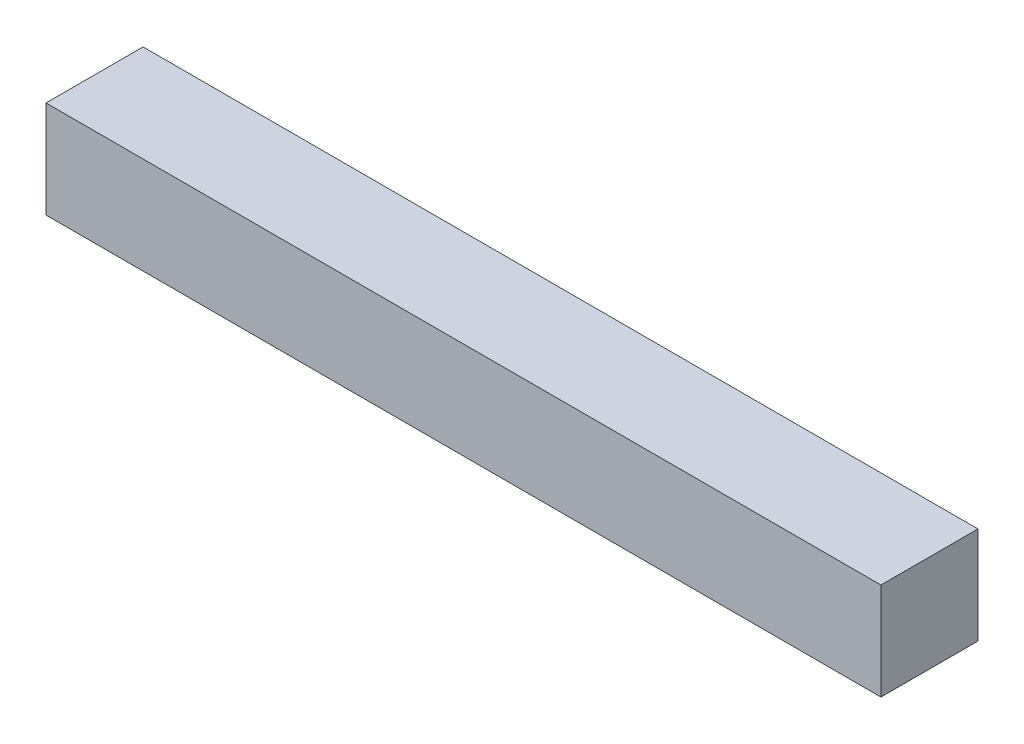
ISO-10303-21;
HEADER;
FILE_DESCRIPTION(('STEP AP214'),'2;1');
FILE_NAME('part.step','',(''),(''),'','','');
FILE_SCHEMA(('AUTOMOTIVE_DESIGN { 1 0 10303 214 1 1 1 1 }'));
ENDSEC;
DATA;
#1=APPLICATION_CONTEXT('core data for automotive mechanical design processes');
#2=APPLICATION_PROTOCOL_DEFINITION('international standard','automotive_design',2000,#1);
#3=PRODUCT_CONTEXT('',#1,'mechanical');
#4=PRODUCT('Part','Part','',(#3));
#5=PRODUCT_RELATED_PRODUCT_CATEGORY('part','',(#4));
#6=PRODUCT_DEFINITION_FORMATION('','',#4);
#7=PRODUCT_DEFINITION_CONTEXT('part definition',#1,'design');
#8=PRODUCT_DEFINITION('design','',#6,#7);
#9=PRODUCT_DEFINITION_SHAPE('','',#8);
#10=(LENGTH_UNIT() NAMED_UNIT(*) SI_UNIT(.MILLI.,.METRE.));
#11=(NAMED_UNIT(*) PLANE_ANGLE_UNIT() SI_UNIT($,.RADIAN.));
#12=(NAMED_UNIT(*) SI_UNIT($,.STERADIAN.) SOLID_ANGLE_UNIT());
#13=UNCERTAINTY_MEASURE_WITH_UNIT(LENGTH_MEASURE(1.E-05),#10,'distance_accuracy_value','');
#14=(GEOMETRIC_REPRESENTATION_CONTEXT(3) GLOBAL_UNCERTAINTY_ASSIGNED_CONTEXT((#13)) GLOBAL_UNIT_ASSIGNED_CONTEXT((#10,
#11,#12)) REPRESENTATION_CONTEXT('',''));
#15=CARTESIAN_POINT('',(0.,0.,0.));
#16=DIRECTION('',(0.,0.,1.));
#17=DIRECTION('',(1.,0.,0.));
#18=AXIS2_PLACEMENT_3D('',#15,#16,#17);
#19=CARTESIAN_POINT('',(86.,-5.,-5.));
#20=DIRECTION('',(0.,0.,1.));
#21=DIRECTION('',(1.,0.,0.));
#22=AXIS2_PLACEMENT_3D('',#19,#20,#21);
#23=PLANE('',#22);
#24=DIRECTION('',(0.,1.,0.));
#25=VECTOR('',#24,1.);
#26=CARTESIAN_POINT('',(0.,-5.,-5.));
#27=LINE('',#26,#25);
#28=CARTESIAN_POINT('',(0.,-5.,-5.));
#29=VERTEX_POINT('',#28);
#30=CARTESIAN_POINT('',(0.,5.,-5.));
#31=VERTEX_POINT('',#30);
#32=EDGE_CURVE('E101',#29,#31,#27,.T.);
#33=ORIENTED_EDGE('',*,*,#32,.T.);
#34=DIRECTION('',(-1.,0.,0.));
#35=VECTOR('',#34,1.);
#36=CARTESIAN_POINT('',(86.,5.,-5.));
#37=LINE('',#36,#35);
#38=CARTESIAN_POINT('',(86.,5.,-5.));
#39=VERTEX_POINT('',#38);
#40=EDGE_CURVE('E11',#39,#31,#37,.T.);
#41=ORIENTED_EDGE('',*,*,#40,.F.);
#42=DIRECTION('',(0.,1.,0.));
#43=VECTOR('',#42,1.);
#44=CARTESIAN_POINT('',(86.,-5.,-5.));
#45=LINE('',#44,#43);
#46=CARTESIAN_POINT('',(86.,-5.,-5.));
#47=VERTEX_POINT('',#46);
#48=EDGE_CURVE('E89',#47,#39,#45,.T.);
#49=ORIENTED_EDGE('',*,*,#48,.F.);
#50=DIRECTION('',(-1.,0.,0.));
#51=VECTOR('',#50,1.);
#52=CARTESIAN_POINT('',(86.,-5.,-5.));
#53=LINE('',#52,#51);
#54=EDGE_CURVE('E97',#47,#29,#53,.T.);
#55=ORIENTED_EDGE('',*,*,#54,.T.);
#56=EDGE_LOOP('',(#33,#41,#49,#55));
#57=FACE_BOUND('',#56,.T.);
#58=ADVANCED_FACE('F38',(#57),#23,.F.);
#59=CARTESIAN_POINT('',(86.,5.,5.));
#60=DIRECTION('',(0.,-1.,0.));
#61=DIRECTION('',(0.,0.,-1.));
#62=AXIS2_PLACEMENT_3D('',#59,#60,#61);
#63=PLANE('',#62);
#64=DIRECTION('',(0.,0.,1.));
#65=VECTOR('',#64,1.);
#66=CARTESIAN_POINT('',(0.,5.,5.));
#67=LINE('',#66,#65);
#68=CARTESIAN_POINT('',(0.,5.,5.));
#69=VERTEX_POINT('',#68);
#70=EDGE_CURVE('E93',#31,#69,#67,.T.);
#71=ORIENTED_EDGE('',*,*,#70,.T.);
#72=DIRECTION('',(-1.,0.,0.));
#73=VECTOR('',#72,1.);
#74=CARTESIAN_POINT('',(86.,5.,5.));
#75=LINE('',#74,#73);
#76=CARTESIAN_POINT('',(86.,5.,5.));
#77=VERTEX_POINT('',#76);
#78=EDGE_CURVE('E46',#77,#69,#75,.T.);
#79=ORIENTED_EDGE('',*,*,#78,.F.);
#80=DIRECTION('',(0.,0.,1.));
#81=VECTOR('',#80,1.);
#82=CARTESIAN_POINT('',(86.,5.,5.));
#83=LINE('',#82,#81);
#84=EDGE_CURVE('E84',#39,#77,#83,.T.);
#85=ORIENTED_EDGE('',*,*,#84,.F.);
#86=ORIENTED_EDGE('',*,*,#40,.T.);
#87=EDGE_LOOP('',(#71,#79,#85,#86));
#88=FACE_BOUND('',#87,.T.);
#89=ADVANCED_FACE('F92',(#88),#63,.F.);
#90=CARTESIAN_POINT('',(86.,-5.,5.));
#91=DIRECTION('',(0.,0.,-1.));
#92=DIRECTION('',(-1.,0.,0.));
#93=AXIS2_PLACEMENT_3D('',#90,#91,#92);
#94=PLANE('',#93);
#95=DIRECTION('',(0.,-1.,0.));
#96=VECTOR('',#95,1.);
#97=CARTESIAN_POINT('',(0.,-5.,5.));
#98=LINE('',#97,#96);
#99=CARTESIAN_POINT('',(0.,-5.,5.));
#100=VERTEX_POINT('',#99);
#101=EDGE_CURVE('E71',#69,#100,#98,.T.);
#102=ORIENTED_EDGE('',*,*,#101,.T.);
#103=DIRECTION('',(-1.,0.,0.));
#104=VECTOR('',#103,1.);
#105=CARTESIAN_POINT('',(86.,-5.,5.));
#106=LINE('',#105,#104);
#107=CARTESIAN_POINT('',(86.,-5.,5.));
#108=VERTEX_POINT('',#107);
#109=EDGE_CURVE('E94',#108,#100,#106,.T.);
#110=ORIENTED_EDGE('',*,*,#109,.F.);
#111=DIRECTION('',(0.,-1.,0.));
#112=VECTOR('',#111,1.);
#113=CARTESIAN_POINT('',(86.,-5.,5.));
#114=LINE('',#113,#112);
#115=EDGE_CURVE('E87',#77,#108,#114,.T.);
#116=ORIENTED_EDGE('',*,*,#115,.F.);
#117=ORIENTED_EDGE('',*,*,#78,.T.);
#118=EDGE_LOOP('',(#102,#110,#116,#117));
#119=FACE_BOUND('',#118,.T.);
#120=ADVANCED_FACE('F95',(#119),#94,.F.);
#121=CARTESIAN_POINT('',(86.,-5.,5.));
#122=DIRECTION('',(0.,1.,0.));
#123=DIRECTION('',(0.,0.,1.));
#124=AXIS2_PLACEMENT_3D('',#121,#122,#123);
#125=PLANE('',#124);
#126=DIRECTION('',(0.,0.,-1.));
#127=VECTOR('',#126,1.);
#128=CARTESIAN_POINT('',(0.,-5.,5.));
#129=LINE('',#128,#127);
#130=EDGE_CURVE('E77',#100,#29,#129,.T.);
#131=ORIENTED_EDGE('',*,*,#130,.T.);
#132=ORIENTED_EDGE('',*,*,#54,.F.);
#133=DIRECTION('',(0.,0.,-1.));
#134=VECTOR('',#133,1.);
#135=CARTESIAN_POINT('',(86.,-5.,5.));
#136=LINE('',#135,#134);
#137=EDGE_CURVE('E54',#108,#47,#136,.T.);
#138=ORIENTED_EDGE('',*,*,#137,.F.);
#139=ORIENTED_EDGE('',*,*,#109,.T.);
#140=EDGE_LOOP('',(#131,#132,#138,#139));
#141=FACE_BOUND('',#140,.T.);
#142=ADVANCED_FACE('F108',(#141),#125,.F.);
#143=CARTESIAN_POINT('',(86.,0.,0.));
#144=DIRECTION('',(-1.,0.,0.));
#145=DIRECTION('',(0.,0.,1.));
#146=AXIS2_PLACEMENT_3D('',#143,#144,#145);
#147=PLANE('',#146);
#148=ORIENTED_EDGE('',*,*,#48,.T.);
#149=ORIENTED_EDGE('',*,*,#84,.T.);
#150=ORIENTED_EDGE('',*,*,#115,.T.);
#151=ORIENTED_EDGE('',*,*,#137,.T.);
#152=EDGE_LOOP('',(#148,#149,#150,#151));
#153=FACE_BOUND('',#152,.T.);
#154=ADVANCED_FACE('F85',(#153),#147,.F.);
#155=CARTESIAN_POINT('',(0.,0.,0.));
#156=DIRECTION('',(-1.,0.,0.));
#157=DIRECTION('',(0.,0.,1.));
#158=AXIS2_PLACEMENT_3D('',#155,#156,#157);
#159=PLANE('',#158);
#160=ORIENTED_EDGE('',*,*,#32,.F.);
#161=ORIENTED_EDGE('',*,*,#130,.F.);
#162=ORIENTED_EDGE('',*,*,#101,.F.);
#163=ORIENTED_EDGE('',*,*,#70,.F.);
#164=EDGE_LOOP('',(#160,#161,#162,#163));
#165=FACE_BOUND('',#164,.T.);
#166=ADVANCED_FACE('F111',(#165),#159,.T.);
#167=CLOSED_SHELL('',(#58,#89,#120,#142,#154,#166));
#168=MANIFOLD_SOLID_BREP('B2',#167);
#169=ADVANCED_BREP_SHAPE_REPRESENTATION('',(#18,#168),#14);
#170=SHAPE_DEFINITION_REPRESENTATION(#9,#169);
ENDSEC;
END-ISO-10303-21;
